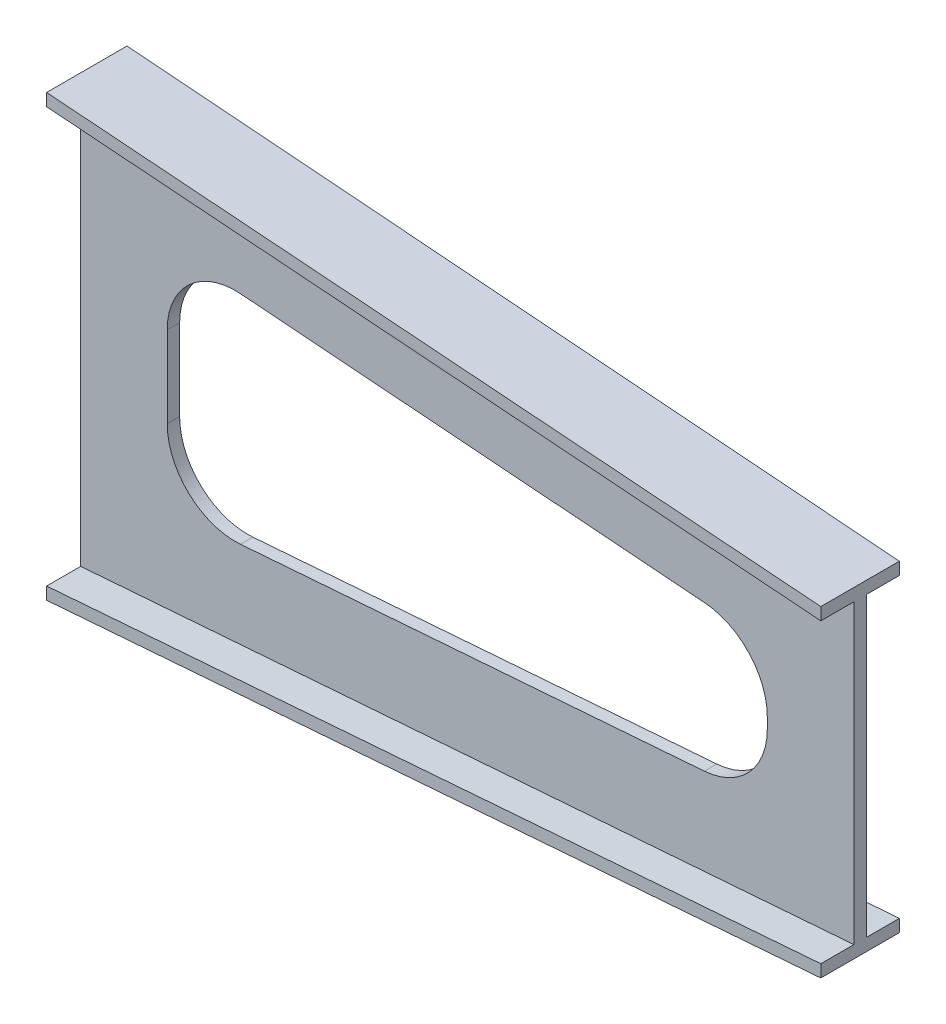
ISO-10303-21;
HEADER;
FILE_DESCRIPTION(('STEP AP214'),'2;1');
FILE_NAME('part.step','',(''),(''),'','','');
FILE_SCHEMA(('AUTOMOTIVE_DESIGN { 1 0 10303 214 1 1 1 1 }'));
ENDSEC;
DATA;
#1=APPLICATION_CONTEXT('core data for automotive mechanical design processes');
#2=APPLICATION_PROTOCOL_DEFINITION('international standard','automotive_design',2000,#1);
#3=PRODUCT_CONTEXT('',#1,'mechanical');
#4=PRODUCT('Part','Part','',(#3));
#5=PRODUCT_RELATED_PRODUCT_CATEGORY('part','',(#4));
#6=PRODUCT_DEFINITION_FORMATION('','',#4);
#7=PRODUCT_DEFINITION_CONTEXT('part definition',#1,'design');
#8=PRODUCT_DEFINITION('design','',#6,#7);
#9=PRODUCT_DEFINITION_SHAPE('','',#8);
#10=(LENGTH_UNIT() NAMED_UNIT(*) SI_UNIT(.MILLI.,.METRE.));
#11=(NAMED_UNIT(*) PLANE_ANGLE_UNIT() SI_UNIT($,.RADIAN.));
#12=(NAMED_UNIT(*) SI_UNIT($,.STERADIAN.) SOLID_ANGLE_UNIT());
#13=UNCERTAINTY_MEASURE_WITH_UNIT(LENGTH_MEASURE(1.E-05),#10,'distance_accuracy_value','');
#14=(GEOMETRIC_REPRESENTATION_CONTEXT(3) GLOBAL_UNCERTAINTY_ASSIGNED_CONTEXT((#13)) GLOBAL_UNIT_ASSIGNED_CONTEXT((#10,
#11,#12)) REPRESENTATION_CONTEXT('',''));
#15=CARTESIAN_POINT('',(0.,0.,0.));
#16=DIRECTION('',(0.,0.,1.));
#17=DIRECTION('',(1.,0.,0.));
#18=AXIS2_PLACEMENT_3D('',#15,#16,#17);
#19=CARTESIAN_POINT('',(1250.,0.,0.));
#20=DIRECTION('',(-1.,0.,0.));
#21=DIRECTION('',(0.,0.,1.));
#22=AXIS2_PLACEMENT_3D('',#19,#20,#21);
#23=PLANE('',#22);
#24=DIRECTION('',(0.,-1.,0.));
#25=VECTOR('',#24,1.);
#26=CARTESIAN_POINT('',(1250.,260.,-53.4999999999997));
#27=LINE('',#26,#25);
#28=CARTESIAN_POINT('',(1250.,260.,-53.4999999999997));
#29=VERTEX_POINT('',#28);
#30=CARTESIAN_POINT('',(1250.,240.,-53.4999999999997));
#31=VERTEX_POINT('',#30);
#32=EDGE_CURVE('E545',#29,#31,#27,.T.);
#33=ORIENTED_EDGE('',*,*,#32,.F.);
#34=DIRECTION('',(0.,0.,-1.));
#35=VECTOR('',#34,1.);
#36=CARTESIAN_POINT('',(1250.,260.,-53.4999999999997));
#37=LINE('',#36,#35);
#38=CARTESIAN_POINT('',(1250.,260.,73.5000000000003));
#39=VERTEX_POINT('',#38);
#40=EDGE_CURVE('E674',#39,#29,#37,.T.);
#41=ORIENTED_EDGE('',*,*,#40,.F.);
#42=DIRECTION('',(0.,1.,0.));
#43=VECTOR('',#42,1.);
#44=CARTESIAN_POINT('',(1250.,260.,73.5000000000003));
#45=LINE('',#44,#43);
#46=CARTESIAN_POINT('',(1250.,240.,73.5000000000003));
#47=VERTEX_POINT('',#46);
#48=EDGE_CURVE('E295',#47,#39,#45,.T.);
#49=ORIENTED_EDGE('',*,*,#48,.F.);
#50=DIRECTION('',(0.,0.,1.));
#51=VECTOR('',#50,1.);
#52=CARTESIAN_POINT('',(1250.,240.,20.0000000000005));
#53=LINE('',#52,#51);
#54=CARTESIAN_POINT('',(1250.,240.,20.0000000000005));
#55=VERTEX_POINT('',#54);
#56=EDGE_CURVE('E309',#55,#47,#53,.T.);
#57=ORIENTED_EDGE('',*,*,#56,.F.);
#58=DIRECTION('',(0.,1.,0.));
#59=VECTOR('',#58,1.);
#60=CARTESIAN_POINT('',(1250.,240.,20.0000000000005));
#61=LINE('',#60,#59);
#62=CARTESIAN_POINT('',(1250.,-240.,20.0000000000005));
#63=VERTEX_POINT('',#62);
#64=EDGE_CURVE('E771',#63,#55,#61,.T.);
#65=ORIENTED_EDGE('',*,*,#64,.F.);
#66=DIRECTION('',(0.,0.,-1.));
#67=VECTOR('',#66,1.);
#68=CARTESIAN_POINT('',(1250.,-240.,20.0000000000005));
#69=LINE('',#68,#67);
#70=CARTESIAN_POINT('',(1250.,-240.,73.5000000000003));
#71=VERTEX_POINT('',#70);
#72=EDGE_CURVE('E774',#71,#63,#69,.T.);
#73=ORIENTED_EDGE('',*,*,#72,.F.);
#74=DIRECTION('',(0.,1.,0.));
#75=VECTOR('',#74,1.);
#76=CARTESIAN_POINT('',(1250.,-240.,73.5000000000003));
#77=LINE('',#76,#75);
#78=CARTESIAN_POINT('',(1250.,-260.,73.5000000000003));
#79=VERTEX_POINT('',#78);
#80=EDGE_CURVE('E777',#79,#71,#77,.T.);
#81=ORIENTED_EDGE('',*,*,#80,.F.);
#82=DIRECTION('',(0.,0.,1.));
#83=VECTOR('',#82,1.);
#84=CARTESIAN_POINT('',(1250.,-260.,-53.4999999999997));
#85=LINE('',#84,#83);
#86=CARTESIAN_POINT('',(1250.,-260.,-53.4999999999997));
#87=VERTEX_POINT('',#86);
#88=EDGE_CURVE('E424',#87,#79,#85,.T.);
#89=ORIENTED_EDGE('',*,*,#88,.F.);
#90=DIRECTION('',(0.,-1.,0.));
#91=VECTOR('',#90,1.);
#92=CARTESIAN_POINT('',(1250.,-240.,-53.4999999999997));
#93=LINE('',#92,#91);
#94=CARTESIAN_POINT('',(1250.,-240.,-53.4999999999997));
#95=VERTEX_POINT('',#94);
#96=EDGE_CURVE('E438',#95,#87,#93,.T.);
#97=ORIENTED_EDGE('',*,*,#96,.F.);
#98=DIRECTION('',(0.,0.,-1.));
#99=VECTOR('',#98,1.);
#100=CARTESIAN_POINT('',(1250.,-240.,-53.4999999999997));
#101=LINE('',#100,#99);
#102=CARTESIAN_POINT('',(1250.,-240.,4.44089209850063E-13));
#103=VERTEX_POINT('',#102);
#104=EDGE_CURVE('E866',#103,#95,#101,.T.);
#105=ORIENTED_EDGE('',*,*,#104,.F.);
#106=DIRECTION('',(0.,-1.,0.));
#107=VECTOR('',#106,1.);
#108=CARTESIAN_POINT('',(1250.,240.,4.44089209850063E-13));
#109=LINE('',#108,#107);
#110=CARTESIAN_POINT('',(1250.,240.,4.44089209850063E-13));
#111=VERTEX_POINT('',#110);
#112=EDGE_CURVE('E689',#111,#103,#109,.T.);
#113=ORIENTED_EDGE('',*,*,#112,.F.);
#114=DIRECTION('',(0.,0.,1.));
#115=VECTOR('',#114,1.);
#116=CARTESIAN_POINT('',(1250.,240.,-53.4999999999997));
#117=LINE('',#116,#115);
#118=EDGE_CURVE('E531',#31,#111,#117,.T.);
#119=ORIENTED_EDGE('',*,*,#118,.F.);
#120=EDGE_LOOP('',(#33,#41,#49,#57,#65,#73,#81,#89,#97,#105,#113,#119));
#121=FACE_BOUND('',#120,.T.);
#122=ADVANCED_FACE('F65',(#121),#23,.F.);
#123=CARTESIAN_POINT('',(0.,0.,0.));
#124=DIRECTION('',(1.,0.,0.));
#125=DIRECTION('',(0.,0.,-1.));
#126=AXIS2_PLACEMENT_3D('',#123,#124,#125);
#127=PLANE('',#126);
#128=DIRECTION('',(0.,-1.,0.));
#129=VECTOR('',#128,1.);
#130=CARTESIAN_POINT('',(0.,355.5,75.0000000000004));
#131=LINE('',#130,#129);
#132=CARTESIAN_POINT('',(0.,355.5,75.0000000000004));
#133=VERTEX_POINT('',#132);
#134=CARTESIAN_POINT('',(0.,335.5,75.0000000000004));
#135=VERTEX_POINT('',#134);
#136=EDGE_CURVE('E240',#133,#135,#131,.T.);
#137=ORIENTED_EDGE('',*,*,#136,.F.);
#138=DIRECTION('',(0.,0.,1.));
#139=VECTOR('',#138,1.);
#140=CARTESIAN_POINT('',(0.,355.5,75.0000000000004));
#141=LINE('',#140,#139);
#142=CARTESIAN_POINT('',(0.,355.5,-54.9999999999996));
#143=VERTEX_POINT('',#142);
#144=EDGE_CURVE('E256',#143,#133,#141,.T.);
#145=ORIENTED_EDGE('',*,*,#144,.F.);
#146=DIRECTION('',(0.,1.,0.));
#147=VECTOR('',#146,1.);
#148=CARTESIAN_POINT('',(0.,355.5,-54.9999999999996));
#149=LINE('',#148,#147);
#150=CARTESIAN_POINT('',(0.,335.5,-54.9999999999996));
#151=VERTEX_POINT('',#150);
#152=EDGE_CURVE('E560',#151,#143,#149,.T.);
#153=ORIENTED_EDGE('',*,*,#152,.F.);
#154=DIRECTION('',(0.,0.,-1.));
#155=VECTOR('',#154,1.);
#156=CARTESIAN_POINT('',(0.,335.5,3.48505541395828E-13));
#157=LINE('',#156,#155);
#158=CARTESIAN_POINT('',(0.,335.5,3.48505541395828E-13));
#159=VERTEX_POINT('',#158);
#160=EDGE_CURVE('E667',#159,#151,#157,.T.);
#161=ORIENTED_EDGE('',*,*,#160,.F.);
#162=DIRECTION('',(0.,1.,0.));
#163=VECTOR('',#162,1.);
#164=CARTESIAN_POINT('',(0.,335.5,3.48505541395828E-13));
#165=LINE('',#164,#163);
#166=CARTESIAN_POINT('',(0.,-335.5,3.48505541395828E-13));
#167=VERTEX_POINT('',#166);
#168=EDGE_CURVE('E498',#167,#159,#165,.T.);
#169=ORIENTED_EDGE('',*,*,#168,.F.);
#170=DIRECTION('',(0.,0.,1.));
#171=VECTOR('',#170,1.);
#172=CARTESIAN_POINT('',(0.,-335.5,3.48505541395828E-13));
#173=LINE('',#172,#171);
#174=CARTESIAN_POINT('',(0.,-335.5,-54.9999999999998));
#175=VERTEX_POINT('',#174);
#176=EDGE_CURVE('E480',#175,#167,#173,.T.);
#177=ORIENTED_EDGE('',*,*,#176,.F.);
#178=DIRECTION('',(0.,1.,0.));
#179=VECTOR('',#178,1.);
#180=CARTESIAN_POINT('',(0.,-335.5,-54.9999999999998));
#181=LINE('',#180,#179);
#182=CARTESIAN_POINT('',(0.,-355.5,-54.9999999999998));
#183=VERTEX_POINT('',#182);
#184=EDGE_CURVE('E660',#183,#175,#181,.T.);
#185=ORIENTED_EDGE('',*,*,#184,.F.);
#186=DIRECTION('',(0.,0.,-1.));
#187=VECTOR('',#186,1.);
#188=CARTESIAN_POINT('',(0.,-355.5,75.0000000000002));
#189=LINE('',#188,#187);
#190=CARTESIAN_POINT('',(0.,-355.5,75.0000000000002));
#191=VERTEX_POINT('',#190);
#192=EDGE_CURVE('E656',#191,#183,#189,.T.);
#193=ORIENTED_EDGE('',*,*,#192,.F.);
#194=DIRECTION('',(0.,-1.,0.));
#195=VECTOR('',#194,1.);
#196=CARTESIAN_POINT('',(0.,-335.5,75.0000000000002));
#197=LINE('',#196,#195);
#198=CARTESIAN_POINT('',(0.,-335.5,75.0000000000002));
#199=VERTEX_POINT('',#198);
#200=EDGE_CURVE('E389',#199,#191,#197,.T.);
#201=ORIENTED_EDGE('',*,*,#200,.F.);
#202=DIRECTION('',(0.,0.,1.));
#203=VECTOR('',#202,1.);
#204=CARTESIAN_POINT('',(0.,-335.5,75.0000000000002));
#205=LINE('',#204,#203);
#206=CARTESIAN_POINT('',(0.,-335.5,20.0000000000004));
#207=VERTEX_POINT('',#206);
#208=EDGE_CURVE('E371',#207,#199,#205,.T.);
#209=ORIENTED_EDGE('',*,*,#208,.F.);
#210=DIRECTION('',(0.,-1.,0.));
#211=VECTOR('',#210,1.);
#212=CARTESIAN_POINT('',(0.,335.5,20.0000000000004));
#213=LINE('',#212,#211);
#214=CARTESIAN_POINT('',(0.,335.5,20.0000000000004));
#215=VERTEX_POINT('',#214);
#216=EDGE_CURVE('E354',#215,#207,#213,.T.);
#217=ORIENTED_EDGE('',*,*,#216,.F.);
#218=DIRECTION('',(0.,0.,-1.));
#219=VECTOR('',#218,1.);
#220=CARTESIAN_POINT('',(0.,335.5,75.0000000000004));
#221=LINE('',#220,#219);
#222=EDGE_CURVE('E644',#135,#215,#221,.T.);
#223=ORIENTED_EDGE('',*,*,#222,.F.);
#224=EDGE_LOOP('',(#137,#145,#153,#161,#169,#177,#185,#193,#201,#209,#217,#223));
#225=FACE_BOUND('',#224,.T.);
#226=ADVANCED_FACE('F572',(#225),#127,.F.);
#227=CARTESIAN_POINT('',(0.,0.,20.0000000000004));
#228=DIRECTION('',(0.,0.,1.));
#229=DIRECTION('',(1.,0.,0.));
#230=AXIS2_PLACEMENT_3D('',#227,#228,#229);
#231=PLANE('',#230);
#232=CARTESIAN_POINT('',(250.,-65.6714415946998,20.0000000000004));
#233=DIRECTION('',(0.,0.,1.));
#234=DIRECTION('',(1.,0.,0.));
#235=AXIS2_PLACEMENT_3D('',#232,#233,#234);
#236=CIRCLE('',#235,110.);
#237=CARTESIAN_POINT('',(140.,-65.6714415946998,20.0000000000004));
#238=VERTEX_POINT('',#237);
#239=CARTESIAN_POINT('',(258.379579946389,-175.351807385128,20.0000000000004));
#240=VERTEX_POINT('',#239);
#241=EDGE_CURVE('E80',#238,#240,#236,.T.);
#242=ORIENTED_EDGE('',*,*,#241,.F.);
#243=DIRECTION('',(0.,-1.,0.));
#244=VECTOR('',#243,1.);
#245=CARTESIAN_POINT('',(140.,65.6714415946998,20.0000000000004));
#246=LINE('',#245,#244);
#247=CARTESIAN_POINT('',(140.,65.6714415946998,20.0000000000004));
#248=VERTEX_POINT('',#247);
#249=EDGE_CURVE('E235',#248,#238,#246,.T.);
#250=ORIENTED_EDGE('',*,*,#249,.F.);
#251=CARTESIAN_POINT('',(250.,65.6714415946998,20.0000000000004));
#252=DIRECTION('',(0.,0.,1.));
#253=DIRECTION('',(-1.,0.,0.));
#254=AXIS2_PLACEMENT_3D('',#251,#252,#253);
#255=CIRCLE('',#254,110.);
#256=CARTESIAN_POINT('',(258.379579946389,175.351807385128,20.0000000000004));
#257=VERTEX_POINT('',#256);
#258=EDGE_CURVE('E232',#257,#248,#255,.T.);
#259=ORIENTED_EDGE('',*,*,#258,.F.);
#260=DIRECTION('',(-0.997094234458436,0.0761779995126245,0.));
#261=VECTOR('',#260,1.);
#262=CARTESIAN_POINT('',(1008.37957994639,118.051807385128,20.0000000000004));
#263=LINE('',#262,#261);
#264=CARTESIAN_POINT('',(1008.37957994639,118.051807385128,20.0000000000004));
#265=VERTEX_POINT('',#264);
#266=EDGE_CURVE('E229',#265,#257,#263,.T.);
#267=ORIENTED_EDGE('',*,*,#266,.F.);
#268=CARTESIAN_POINT('',(1000.,8.37144159469983,20.0000000000004));
#269=DIRECTION('',(0.,0.,1.));
#270=DIRECTION('',(1.,0.,0.));
#271=AXIS2_PLACEMENT_3D('',#268,#269,#270);
#272=CIRCLE('',#271,110.);
#273=CARTESIAN_POINT('',(1110.,8.37144159469983,20.0000000000004));
#274=VERTEX_POINT('',#273);
#275=EDGE_CURVE('E223',#274,#265,#272,.T.);
#276=ORIENTED_EDGE('',*,*,#275,.F.);
#277=DIRECTION('',(0.,1.,0.));
#278=VECTOR('',#277,1.);
#279=CARTESIAN_POINT('',(1110.,-8.37144159469986,20.0000000000004));
#280=LINE('',#279,#278);
#281=CARTESIAN_POINT('',(1110.,-8.37144159469986,20.0000000000004));
#282=VERTEX_POINT('',#281);
#283=EDGE_CURVE('E221',#282,#274,#280,.T.);
#284=ORIENTED_EDGE('',*,*,#283,.F.);
#285=CARTESIAN_POINT('',(1000.,-8.37144159469986,20.0000000000004));
#286=DIRECTION('',(0.,0.,1.));
#287=DIRECTION('',(-1.,0.,0.));
#288=AXIS2_PLACEMENT_3D('',#285,#286,#287);
#289=CIRCLE('',#288,110.);
#290=CARTESIAN_POINT('',(1008.37957994639,-118.051807385128,20.0000000000004));
#291=VERTEX_POINT('',#290);
#292=EDGE_CURVE('E204',#291,#282,#289,.T.);
#293=ORIENTED_EDGE('',*,*,#292,.F.);
#294=DIRECTION('',(0.997094234458436,0.0761779995126245,0.));
#295=VECTOR('',#294,1.);
#296=CARTESIAN_POINT('',(258.379579946389,-175.351807385128,20.0000000000004));
#297=LINE('',#296,#295);
#298=EDGE_CURVE('E213',#240,#291,#297,.T.);
#299=ORIENTED_EDGE('',*,*,#298,.F.);
#300=EDGE_LOOP('',(#242,#250,#259,#267,#276,#284,#293,#299));
#301=FACE_BOUND('',#300,.T.);
#302=DIRECTION('',(0.997094234458436,0.0761779995126245,0.));
#303=VECTOR('',#302,1.);
#304=CARTESIAN_POINT('',(0.,-335.5,20.0000000000004));
#305=LINE('',#304,#303);
#306=EDGE_CURVE('E347',#207,#63,#305,.T.);
#307=ORIENTED_EDGE('',*,*,#306,.T.);
#308=ORIENTED_EDGE('',*,*,#64,.T.);
#309=DIRECTION('',(0.997094234458436,-0.0761779995126245,0.));
#310=VECTOR('',#309,1.);
#311=CARTESIAN_POINT('',(0.,335.5,20.0000000000004));
#312=LINE('',#311,#310);
#313=EDGE_CURVE('E339',#215,#55,#312,.T.);
#314=ORIENTED_EDGE('',*,*,#313,.F.);
#315=ORIENTED_EDGE('',*,*,#216,.T.);
#316=EDGE_LOOP('',(#307,#308,#314,#315));
#317=FACE_BOUND('',#316,.T.);
#318=ADVANCED_FACE('F217',(#301,#317),#231,.T.);
#319=CARTESIAN_POINT('',(25.4834540977695,333.55306410693,1.73045930703638E-13));
#320=DIRECTION('',(-0.0761779995126245,-0.997094234458436,0.));
#321=DIRECTION('',(0.997094234458436,-0.0761779995126245,0.));
#322=AXIS2_PLACEMENT_3D('',#319,#320,#321);
#323=PLANE('',#322);
#324=ORIENTED_EDGE('',*,*,#313,.T.);
#325=ORIENTED_EDGE('',*,*,#56,.T.);
#326=DIRECTION('',(0.997093520717436,-0.0761779449828121,-0.00119651222486096));
#327=VECTOR('',#326,1.);
#328=CARTESIAN_POINT('',(0.,335.5,75.0000000000004));
#329=LINE('',#328,#327);
#330=EDGE_CURVE('E676',#135,#47,#329,.T.);
#331=ORIENTED_EDGE('',*,*,#330,.F.);
#332=ORIENTED_EDGE('',*,*,#222,.T.);
#333=EDGE_LOOP('',(#324,#325,#331,#332));
#334=FACE_BOUND('',#333,.T.);
#335=ADVANCED_FACE('F316',(#334),#323,.T.);
#336=CARTESIAN_POINT('',(25.4834540977695,-333.55306410693,0.));
#337=DIRECTION('',(-0.0761779995126245,0.997094234458436,0.));
#338=DIRECTION('',(-0.997094234458436,-0.0761779995126245,0.));
#339=AXIS2_PLACEMENT_3D('',#336,#337,#338);
#340=PLANE('',#339);
#341=DIRECTION('',(0.997093520717436,0.0761779449828121,-0.0011965122248608));
#342=VECTOR('',#341,1.);
#343=CARTESIAN_POINT('',(0.,-335.5,75.0000000000002));
#344=LINE('',#343,#342);
#345=EDGE_CURVE('E346',#199,#71,#344,.T.);
#346=ORIENTED_EDGE('',*,*,#345,.T.);
#347=ORIENTED_EDGE('',*,*,#72,.T.);
#348=ORIENTED_EDGE('',*,*,#306,.F.);
#349=ORIENTED_EDGE('',*,*,#208,.T.);
#350=EDGE_LOOP('',(#346,#347,#348,#349));
#351=FACE_BOUND('',#350,.T.);
#352=ADVANCED_FACE('F326',(#351),#340,.T.);
#353=CARTESIAN_POINT('',(0.0899998704001769,0.,74.9998920001557));
#354=DIRECTION('',(0.0011999991360008,0.,0.999999280000778));
#355=DIRECTION('',(0.999999280000778,0.,-0.0011999991360008));
#356=AXIS2_PLACEMENT_3D('',#353,#354,#355);
#357=PLANE('',#356);
#358=DIRECTION('',(0.997093520717436,0.0761779449828121,-0.00119651222486079));
#359=VECTOR('',#358,1.);
#360=CARTESIAN_POINT('',(0.,-355.5,75.0000000000002));
#361=LINE('',#360,#359);
#362=EDGE_CURVE('E382',#191,#79,#361,.T.);
#363=ORIENTED_EDGE('',*,*,#362,.T.);
#364=ORIENTED_EDGE('',*,*,#80,.T.);
#365=ORIENTED_EDGE('',*,*,#345,.F.);
#366=ORIENTED_EDGE('',*,*,#200,.T.);
#367=EDGE_LOOP('',(#363,#364,#365,#366));
#368=FACE_BOUND('',#367,.T.);
#369=ADVANCED_FACE('F395',(#368),#357,.T.);
#370=CARTESIAN_POINT('',(27.0025869799018,-353.437002354735,0.));
#371=DIRECTION('',(0.0761779995126245,-0.997094234458436,0.));
#372=DIRECTION('',(0.997094234458436,0.0761779995126245,0.));
#373=AXIS2_PLACEMENT_3D('',#370,#371,#372);
#374=PLANE('',#373);
#375=DIRECTION('',(0.997093520717436,0.076177944982812,0.00119651222486106));
#376=VECTOR('',#375,1.);
#377=CARTESIAN_POINT('',(0.,-355.5,-54.9999999999998));
#378=LINE('',#377,#376);
#379=EDGE_CURVE('E472',#183,#87,#378,.T.);
#380=ORIENTED_EDGE('',*,*,#379,.T.);
#381=ORIENTED_EDGE('',*,*,#88,.T.);
#382=ORIENTED_EDGE('',*,*,#362,.F.);
#383=ORIENTED_EDGE('',*,*,#192,.T.);
#384=EDGE_LOOP('',(#380,#381,#382,#383));
#385=FACE_BOUND('',#384,.T.);
#386=ADVANCED_FACE('F404',(#385),#374,.T.);
#387=CARTESIAN_POINT('',(0.0659999049601447,0.,-54.9999208001139));
#388=DIRECTION('',(0.00119999913600108,0.,-0.999999280000778));
#389=DIRECTION('',(-0.999999280000778,0.,-0.00119999913600108));
#390=AXIS2_PLACEMENT_3D('',#387,#388,#389);
#391=PLANE('',#390);
#392=DIRECTION('',(0.997093520717436,0.076177944982812,0.00119651222486107));
#393=VECTOR('',#392,1.);
#394=CARTESIAN_POINT('',(0.,-335.5,-54.9999999999998));
#395=LINE('',#394,#393);
#396=EDGE_CURVE('E464',#175,#95,#395,.T.);
#397=ORIENTED_EDGE('',*,*,#396,.T.);
#398=ORIENTED_EDGE('',*,*,#96,.T.);
#399=ORIENTED_EDGE('',*,*,#379,.F.);
#400=ORIENTED_EDGE('',*,*,#184,.T.);
#401=EDGE_LOOP('',(#397,#398,#399,#400));
#402=FACE_BOUND('',#401,.T.);
#403=ADVANCED_FACE('F444',(#402),#391,.T.);
#404=CARTESIAN_POINT('',(25.4834540977695,-333.553064106931,0.));
#405=DIRECTION('',(-0.0761779995126246,0.997094234458436,0.));
#406=DIRECTION('',(-0.997094234458436,-0.0761779995126246,0.));
#407=AXIS2_PLACEMENT_3D('',#404,#405,#406);
#408=PLANE('',#407);
#409=DIRECTION('',(0.997094234458436,0.0761779995126246,0.));
#410=VECTOR('',#409,1.);
#411=CARTESIAN_POINT('',(0.,-335.5,3.48505541395828E-13));
#412=LINE('',#411,#410);
#413=EDGE_CURVE('E471',#167,#103,#412,.T.);
#414=ORIENTED_EDGE('',*,*,#413,.T.);
#415=ORIENTED_EDGE('',*,*,#104,.T.);
#416=ORIENTED_EDGE('',*,*,#396,.F.);
#417=ORIENTED_EDGE('',*,*,#176,.T.);
#418=EDGE_LOOP('',(#414,#415,#416,#417));
#419=FACE_BOUND('',#418,.T.);
#420=ADVANCED_FACE('F453',(#419),#408,.T.);
#421=CARTESIAN_POINT('',(0.,0.,3.48505541395828E-13));
#422=DIRECTION('',(0.,0.,-1.));
#423=DIRECTION('',(-1.,0.,0.));
#424=AXIS2_PLACEMENT_3D('',#421,#422,#423);
#425=PLANE('',#424);
#426=CARTESIAN_POINT('',(250.,-65.6714415946998,3.67761376907083E-13));
#427=DIRECTION('',(0.,0.,-1.));
#428=DIRECTION('',(-1.,0.,0.));
#429=AXIS2_PLACEMENT_3D('',#426,#427,#428);
#430=CIRCLE('',#429,110.);
#431=CARTESIAN_POINT('',(258.379579946389,-175.351807385128,3.95516952522712E-13));
#432=VERTEX_POINT('',#431);
#433=CARTESIAN_POINT('',(140.,-65.6714415946998,3.60822483003176E-13));
#434=VERTEX_POINT('',#433);
#435=EDGE_CURVE('E12',#432,#434,#430,.T.);
#436=ORIENTED_EDGE('',*,*,#435,.F.);
#437=DIRECTION('',(-0.997094234458436,-0.0761779995126245,0.));
#438=VECTOR('',#437,1.);
#439=CARTESIAN_POINT('',(14.818534166002,-193.959871282749,3.49638669281189E-13));
#440=LINE('',#439,#438);
#441=CARTESIAN_POINT('',(1008.37957994639,-118.051807385128,4.25613236952321E-13));
#442=VERTEX_POINT('',#441);
#443=EDGE_CURVE('E709',#442,#432,#440,.T.);
#444=ORIENTED_EDGE('',*,*,#443,.F.);
#445=CARTESIAN_POINT('',(1000.,-8.37144159469986,4.23272528138341E-13));
#446=DIRECTION('',(0.,0.,-1.));
#447=DIRECTION('',(-1.,0.,0.));
#448=AXIS2_PLACEMENT_3D('',#445,#446,#447);
#449=CIRCLE('',#448,110.);
#450=CARTESIAN_POINT('',(1110.,-8.37144159469986,4.16333634234434E-13));
#451=VERTEX_POINT('',#450);
#452=EDGE_CURVE('E207',#451,#442,#449,.T.);
#453=ORIENTED_EDGE('',*,*,#452,.F.);
#454=DIRECTION('',(0.,-1.,0.));
#455=VECTOR('',#454,1.);
#456=CARTESIAN_POINT('',(1110.,0.,4.33383838983188E-13));
#457=LINE('',#456,#455);
#458=CARTESIAN_POINT('',(1110.,8.37144159469983,4.30211422042248E-13));
#459=VERTEX_POINT('',#458);
#460=EDGE_CURVE('E717',#459,#451,#457,.T.);
#461=ORIENTED_EDGE('',*,*,#460,.F.);
#462=CARTESIAN_POINT('',(1000.,8.37144159469983,4.23272528138341E-13));
#463=DIRECTION('',(0.,0.,-1.));
#464=DIRECTION('',(-1.,0.,0.));
#465=AXIS2_PLACEMENT_3D('',#462,#463,#464);
#466=CIRCLE('',#465,110.);
#467=CARTESIAN_POINT('',(1008.37957994639,118.051807385128,4.16333634234434E-13));
#468=VERTEX_POINT('',#467);
#469=EDGE_CURVE('E719',#468,#459,#466,.T.);
#470=ORIENTED_EDGE('',*,*,#469,.F.);
#471=DIRECTION('',(0.997094234458436,-0.0761779995126245,0.));
#472=VECTOR('',#471,1.);
#473=CARTESIAN_POINT('',(14.818534166002,193.959871282749,3.49638669281189E-13));
#474=LINE('',#473,#472);
#475=CARTESIAN_POINT('',(258.379579946389,175.351807385128,3.95516952522712E-13));
#476=VERTEX_POINT('',#475);
#477=EDGE_CURVE('E721',#476,#468,#474,.T.);
#478=ORIENTED_EDGE('',*,*,#477,.F.);
#479=CARTESIAN_POINT('',(250.,65.6714415946998,3.67761376907083E-13));
#480=DIRECTION('',(0.,0.,-1.));
#481=DIRECTION('',(-1.,0.,0.));
#482=AXIS2_PLACEMENT_3D('',#479,#480,#481);
#483=CIRCLE('',#482,110.);
#484=CARTESIAN_POINT('',(140.,65.6714415946998,3.60822483003176E-13));
#485=VERTEX_POINT('',#484);
#486=EDGE_CURVE('E723',#485,#476,#483,.T.);
#487=ORIENTED_EDGE('',*,*,#486,.F.);
#488=DIRECTION('',(0.,1.,0.));
#489=VECTOR('',#488,1.);
#490=CARTESIAN_POINT('',(140.,0.,3.59210912262703E-13));
#491=LINE('',#490,#489);
#492=EDGE_CURVE('E73',#434,#485,#491,.T.);
#493=ORIENTED_EDGE('',*,*,#492,.F.);
#494=EDGE_LOOP('',(#436,#444,#453,#461,#470,#478,#487,#493));
#495=FACE_BOUND('',#494,.T.);
#496=DIRECTION('',(0.997094234458436,-0.0761779995126246,0.));
#497=VECTOR('',#496,1.);
#498=CARTESIAN_POINT('',(0.,335.5,3.48505541395828E-13));
#499=LINE('',#498,#497);
#500=EDGE_CURVE('E491',#159,#111,#499,.T.);
#501=ORIENTED_EDGE('',*,*,#500,.T.);
#502=ORIENTED_EDGE('',*,*,#112,.T.);
#503=ORIENTED_EDGE('',*,*,#413,.F.);
#504=ORIENTED_EDGE('',*,*,#168,.T.);
#505=EDGE_LOOP('',(#501,#502,#503,#504));
#506=FACE_BOUND('',#505,.T.);
#507=ADVANCED_FACE('F504',(#495,#506),#425,.T.);
#508=CARTESIAN_POINT('',(25.4834540977695,333.55306410693,0.));
#509=DIRECTION('',(-0.0761779995126246,-0.997094234458436,0.));
#510=DIRECTION('',(0.997094234458436,-0.0761779995126246,0.));
#511=AXIS2_PLACEMENT_3D('',#508,#509,#510);
#512=PLANE('',#511);
#513=DIRECTION('',(0.997093520717436,-0.0761779449828121,0.00119651222486089));
#514=VECTOR('',#513,1.);
#515=CARTESIAN_POINT('',(0.,335.5,-54.9999999999996));
#516=LINE('',#515,#514);
#517=EDGE_CURVE('E672',#151,#31,#516,.T.);
#518=ORIENTED_EDGE('',*,*,#517,.T.);
#519=ORIENTED_EDGE('',*,*,#118,.T.);
#520=ORIENTED_EDGE('',*,*,#500,.F.);
#521=ORIENTED_EDGE('',*,*,#160,.T.);
#522=EDGE_LOOP('',(#518,#519,#520,#521));
#523=FACE_BOUND('',#522,.T.);
#524=ADVANCED_FACE('F512',(#523),#512,.T.);
#525=CARTESIAN_POINT('',(0.0659999049601346,0.,-54.9999208001137));
#526=DIRECTION('',(0.0011999991360009,0.,-0.999999280000778));
#527=DIRECTION('',(-0.999999280000778,0.,-0.0011999991360009));
#528=AXIS2_PLACEMENT_3D('',#525,#526,#527);
#529=PLANE('',#528);
#530=DIRECTION('',(0.997093520717436,-0.0761779449828122,0.00119651222486089));
#531=VECTOR('',#530,1.);
#532=CARTESIAN_POINT('',(0.,355.5,-54.9999999999996));
#533=LINE('',#532,#531);
#534=EDGE_CURVE('E262',#143,#29,#533,.T.);
#535=ORIENTED_EDGE('',*,*,#534,.T.);
#536=ORIENTED_EDGE('',*,*,#32,.T.);
#537=ORIENTED_EDGE('',*,*,#517,.F.);
#538=ORIENTED_EDGE('',*,*,#152,.T.);
#539=EDGE_LOOP('',(#535,#536,#537,#538));
#540=FACE_BOUND('',#539,.T.);
#541=ADVANCED_FACE('F274',(#540),#529,.T.);
#542=CARTESIAN_POINT('',(27.0025869799018,353.437002354736,0.));
#543=DIRECTION('',(0.0761779995126245,0.997094234458436,0.));
#544=DIRECTION('',(-0.997094234458436,0.0761779995126245,0.));
#545=AXIS2_PLACEMENT_3D('',#542,#543,#544);
#546=PLANE('',#545);
#547=DIRECTION('',(0.997093520717436,-0.0761779449828121,-0.00119651222486096));
#548=VECTOR('',#547,1.);
#549=CARTESIAN_POINT('',(0.,355.5,75.0000000000004));
#550=LINE('',#549,#548);
#551=EDGE_CURVE('E675',#133,#39,#550,.T.);
#552=ORIENTED_EDGE('',*,*,#551,.T.);
#553=ORIENTED_EDGE('',*,*,#40,.T.);
#554=ORIENTED_EDGE('',*,*,#534,.F.);
#555=ORIENTED_EDGE('',*,*,#144,.T.);
#556=EDGE_LOOP('',(#552,#553,#554,#555));
#557=FACE_BOUND('',#556,.T.);
#558=ADVANCED_FACE('F264',(#557),#546,.T.);
#559=CARTESIAN_POINT('',(0.0899998704001897,0.,74.9998920001559));
#560=DIRECTION('',(0.00119999913600097,0.,0.999999280000778));
#561=DIRECTION('',(0.999999280000778,0.,-0.00119999913600097));
#562=AXIS2_PLACEMENT_3D('',#559,#560,#561);
#563=PLANE('',#562);
#564=ORIENTED_EDGE('',*,*,#330,.T.);
#565=ORIENTED_EDGE('',*,*,#48,.T.);
#566=ORIENTED_EDGE('',*,*,#551,.F.);
#567=ORIENTED_EDGE('',*,*,#136,.T.);
#568=EDGE_LOOP('',(#564,#565,#566,#567));
#569=FACE_BOUND('',#568,.T.);
#570=ADVANCED_FACE('F273',(#569),#563,.T.);
#571=CARTESIAN_POINT('',(250.,-65.6714415946998,-55.0000999999999));
#572=DIRECTION('',(0.,0.,1.));
#573=DIRECTION('',(1.,0.,0.));
#574=AXIS2_PLACEMENT_3D('',#571,#572,#573);
#575=CYLINDRICAL_SURFACE('',#574,110.);
#576=ORIENTED_EDGE('',*,*,#435,.T.);
#577=DIRECTION('',(0.,0.,1.));
#578=VECTOR('',#577,1.);
#579=CARTESIAN_POINT('',(140.,-65.6714415946998,-55.0000999999999));
#580=LINE('',#579,#578);
#581=EDGE_CURVE('E238',#434,#238,#580,.T.);
#582=ORIENTED_EDGE('',*,*,#581,.T.);
#583=ORIENTED_EDGE('',*,*,#241,.T.);
#584=DIRECTION('',(0.,0.,1.));
#585=VECTOR('',#584,1.);
#586=CARTESIAN_POINT('',(258.379579946389,-175.351807385128,-55.0000999999999));
#587=LINE('',#586,#585);
#588=EDGE_CURVE('E210',#432,#240,#587,.T.);
#589=ORIENTED_EDGE('',*,*,#588,.F.);
#590=EDGE_LOOP('',(#576,#582,#583,#589));
#591=FACE_BOUND('',#590,.T.);
#592=ADVANCED_FACE('F581',(#591),#575,.F.);
#593=CARTESIAN_POINT('',(140.,65.6714415946998,-55.0000999999999));
#594=DIRECTION('',(-1.,0.,0.));
#595=DIRECTION('',(0.,0.,1.));
#596=AXIS2_PLACEMENT_3D('',#593,#594,#595);
#597=PLANE('',#596);
#598=ORIENTED_EDGE('',*,*,#492,.T.);
#599=DIRECTION('',(0.,0.,1.));
#600=VECTOR('',#599,1.);
#601=CARTESIAN_POINT('',(140.,65.6714415946998,-55.0000999999999));
#602=LINE('',#601,#600);
#603=EDGE_CURVE('E241',#485,#248,#602,.T.);
#604=ORIENTED_EDGE('',*,*,#603,.T.);
#605=ORIENTED_EDGE('',*,*,#249,.T.);
#606=ORIENTED_EDGE('',*,*,#581,.F.);
#607=EDGE_LOOP('',(#598,#604,#605,#606));
#608=FACE_BOUND('',#607,.T.);
#609=ADVANCED_FACE('F728',(#608),#597,.F.);
#610=CARTESIAN_POINT('',(250.,65.6714415946998,-55.0000999999999));
#611=DIRECTION('',(0.,0.,1.));
#612=DIRECTION('',(1.,0.,0.));
#613=AXIS2_PLACEMENT_3D('',#610,#611,#612);
#614=CYLINDRICAL_SURFACE('',#613,110.);
#615=ORIENTED_EDGE('',*,*,#486,.T.);
#616=DIRECTION('',(0.,0.,1.));
#617=VECTOR('',#616,1.);
#618=CARTESIAN_POINT('',(258.379579946389,175.351807385128,-55.0000999999999));
#619=LINE('',#618,#617);
#620=EDGE_CURVE('E243',#476,#257,#619,.T.);
#621=ORIENTED_EDGE('',*,*,#620,.T.);
#622=ORIENTED_EDGE('',*,*,#258,.T.);
#623=ORIENTED_EDGE('',*,*,#603,.F.);
#624=EDGE_LOOP('',(#615,#621,#622,#623));
#625=FACE_BOUND('',#624,.T.);
#626=ADVANCED_FACE('F732',(#625),#614,.F.);
#627=CARTESIAN_POINT('',(1008.37957994639,118.051807385128,-55.0000999999999));
#628=DIRECTION('',(0.0761779995126245,0.997094234458436,0.));
#629=DIRECTION('',(-0.997094234458436,0.0761779995126245,0.));
#630=AXIS2_PLACEMENT_3D('',#627,#628,#629);
#631=PLANE('',#630);
#632=ORIENTED_EDGE('',*,*,#477,.T.);
#633=DIRECTION('',(0.,0.,1.));
#634=VECTOR('',#633,1.);
#635=CARTESIAN_POINT('',(1008.37957994639,118.051807385128,-55.0000999999999));
#636=LINE('',#635,#634);
#637=EDGE_CURVE('E245',#468,#265,#636,.T.);
#638=ORIENTED_EDGE('',*,*,#637,.T.);
#639=ORIENTED_EDGE('',*,*,#266,.T.);
#640=ORIENTED_EDGE('',*,*,#620,.F.);
#641=EDGE_LOOP('',(#632,#638,#639,#640));
#642=FACE_BOUND('',#641,.T.);
#643=ADVANCED_FACE('F741',(#642),#631,.F.);
#644=CARTESIAN_POINT('',(1000.,8.37144159469983,-55.0000999999999));
#645=DIRECTION('',(0.,0.,1.));
#646=DIRECTION('',(1.,0.,0.));
#647=AXIS2_PLACEMENT_3D('',#644,#645,#646);
#648=CYLINDRICAL_SURFACE('',#647,110.);
#649=ORIENTED_EDGE('',*,*,#469,.T.);
#650=DIRECTION('',(0.,0.,1.));
#651=VECTOR('',#650,1.);
#652=CARTESIAN_POINT('',(1110.,8.37144159469983,-55.0000999999999));
#653=LINE('',#652,#651);
#654=EDGE_CURVE('E247',#459,#274,#653,.T.);
#655=ORIENTED_EDGE('',*,*,#654,.T.);
#656=ORIENTED_EDGE('',*,*,#275,.T.);
#657=ORIENTED_EDGE('',*,*,#637,.F.);
#658=EDGE_LOOP('',(#649,#655,#656,#657));
#659=FACE_BOUND('',#658,.T.);
#660=ADVANCED_FACE('F743',(#659),#648,.F.);
#661=CARTESIAN_POINT('',(1110.,-8.37144159469986,-55.0000999999999));
#662=DIRECTION('',(1.,0.,0.));
#663=DIRECTION('',(0.,0.,-1.));
#664=AXIS2_PLACEMENT_3D('',#661,#662,#663);
#665=PLANE('',#664);
#666=ORIENTED_EDGE('',*,*,#460,.T.);
#667=DIRECTION('',(0.,0.,1.));
#668=VECTOR('',#667,1.);
#669=CARTESIAN_POINT('',(1110.,-8.37144159469986,-55.0000999999999));
#670=LINE('',#669,#668);
#671=EDGE_CURVE('E209',#451,#282,#670,.T.);
#672=ORIENTED_EDGE('',*,*,#671,.T.);
#673=ORIENTED_EDGE('',*,*,#283,.T.);
#674=ORIENTED_EDGE('',*,*,#654,.F.);
#675=EDGE_LOOP('',(#666,#672,#673,#674));
#676=FACE_BOUND('',#675,.T.);
#677=ADVANCED_FACE('F747',(#676),#665,.F.);
#678=CARTESIAN_POINT('',(1000.,-8.37144159469986,-55.0000999999999));
#679=DIRECTION('',(0.,0.,1.));
#680=DIRECTION('',(1.,0.,0.));
#681=AXIS2_PLACEMENT_3D('',#678,#679,#680);
#682=CYLINDRICAL_SURFACE('',#681,110.);
#683=ORIENTED_EDGE('',*,*,#452,.T.);
#684=DIRECTION('',(0.,0.,1.));
#685=VECTOR('',#684,1.);
#686=CARTESIAN_POINT('',(1008.37957994639,-118.051807385128,-55.0000999999999));
#687=LINE('',#686,#685);
#688=EDGE_CURVE('E88',#442,#291,#687,.T.);
#689=ORIENTED_EDGE('',*,*,#688,.T.);
#690=ORIENTED_EDGE('',*,*,#292,.T.);
#691=ORIENTED_EDGE('',*,*,#671,.F.);
#692=EDGE_LOOP('',(#683,#689,#690,#691));
#693=FACE_BOUND('',#692,.T.);
#694=ADVANCED_FACE('F201',(#693),#682,.F.);
#695=CARTESIAN_POINT('',(258.379579946389,-175.351807385128,-55.0000999999999));
#696=DIRECTION('',(0.0761779995126245,-0.997094234458436,0.));
#697=DIRECTION('',(0.997094234458436,0.0761779995126245,0.));
#698=AXIS2_PLACEMENT_3D('',#695,#696,#697);
#699=PLANE('',#698);
#700=ORIENTED_EDGE('',*,*,#443,.T.);
#701=ORIENTED_EDGE('',*,*,#588,.T.);
#702=ORIENTED_EDGE('',*,*,#298,.T.);
#703=ORIENTED_EDGE('',*,*,#688,.F.);
#704=EDGE_LOOP('',(#700,#701,#702,#703));
#705=FACE_BOUND('',#704,.T.);
#706=ADVANCED_FACE('F214',(#705),#699,.F.);
#707=CLOSED_SHELL('',(#122,#226,#318,#335,#352,#369,#386,#403,#420,#507,#524,#541,#558,#570,
#592,#609,#626,#643,#660,#677,#694,#706));
#708=MANIFOLD_SOLID_BREP('B2',#707);
#709=ADVANCED_BREP_SHAPE_REPRESENTATION('',(#18,#708),#14);
#710=SHAPE_DEFINITION_REPRESENTATION(#9,#709);
ENDSEC;
END-ISO-10303-21;
